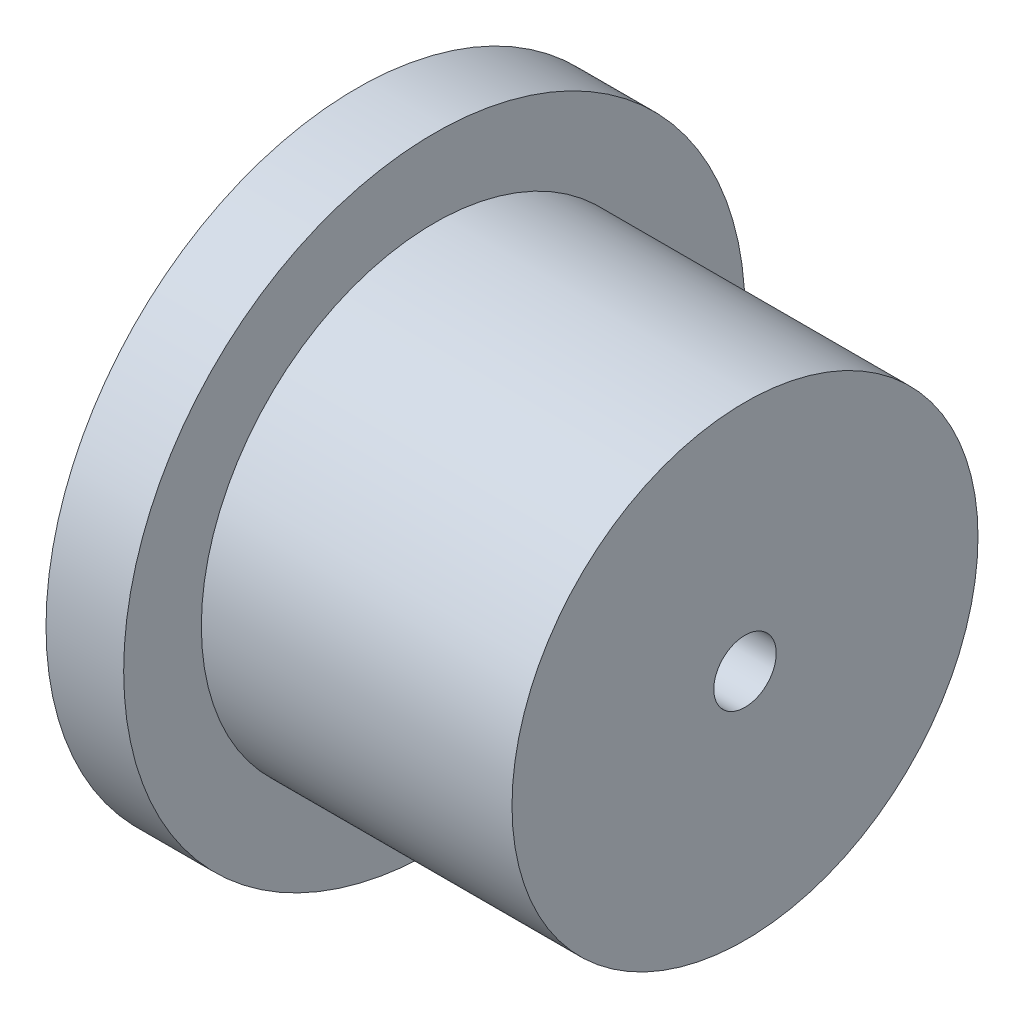
ISO-10303-21;
HEADER;
FILE_DESCRIPTION(('STEP AP214'),'2;1');
FILE_NAME('part.step','',(''),(''),'','','');
FILE_SCHEMA(('AUTOMOTIVE_DESIGN { 1 0 10303 214 1 1 1 1 }'));
ENDSEC;
DATA;
#1=APPLICATION_CONTEXT('core data for automotive mechanical design processes');
#2=APPLICATION_PROTOCOL_DEFINITION('international standard','automotive_design',2000,#1);
#3=PRODUCT_CONTEXT('',#1,'mechanical');
#4=PRODUCT('Part','Part','',(#3));
#5=PRODUCT_RELATED_PRODUCT_CATEGORY('part','',(#4));
#6=PRODUCT_DEFINITION_FORMATION('','',#4);
#7=PRODUCT_DEFINITION_CONTEXT('part definition',#1,'design');
#8=PRODUCT_DEFINITION('design','',#6,#7);
#9=PRODUCT_DEFINITION_SHAPE('','',#8);
#10=(LENGTH_UNIT() NAMED_UNIT(*) SI_UNIT(.MILLI.,.METRE.));
#11=(NAMED_UNIT(*) PLANE_ANGLE_UNIT() SI_UNIT($,.RADIAN.));
#12=(NAMED_UNIT(*) SI_UNIT($,.STERADIAN.) SOLID_ANGLE_UNIT());
#13=UNCERTAINTY_MEASURE_WITH_UNIT(LENGTH_MEASURE(1.E-05),#10,'distance_accuracy_value','');
#14=(GEOMETRIC_REPRESENTATION_CONTEXT(3) GLOBAL_UNCERTAINTY_ASSIGNED_CONTEXT((#13)) GLOBAL_UNIT_ASSIGNED_CONTEXT((#10,
#11,#12)) REPRESENTATION_CONTEXT('',''));
#15=CARTESIAN_POINT('',(0.,0.,0.));
#16=DIRECTION('',(0.,0.,1.));
#17=DIRECTION('',(1.,0.,0.));
#18=AXIS2_PLACEMENT_3D('',#15,#16,#17);
#19=CARTESIAN_POINT('',(0.,0.,0.));
#20=DIRECTION('',(1.,0.,0.));
#21=DIRECTION('',(0.,0.,-1.));
#22=AXIS2_PLACEMENT_3D('',#19,#20,#21);
#23=PLANE('',#22);
#24=CARTESIAN_POINT('',(0.,0.,0.));
#25=DIRECTION('',(-1.,0.,0.));
#26=DIRECTION('',(0.,0.,1.));
#27=AXIS2_PLACEMENT_3D('',#24,#25,#26);
#28=CIRCLE('',#27,2.5527);
#29=CARTESIAN_POINT('',(0.,0.,2.5527));
#30=VERTEX_POINT('',#29);
#31=EDGE_CURVE('E58',#30,#30,#28,.T.);
#32=ORIENTED_EDGE('',*,*,#31,.T.);
#33=EDGE_LOOP('',(#32));
#34=FACE_BOUND('',#33,.T.);
#35=CARTESIAN_POINT('',(0.,0.,0.));
#36=DIRECTION('',(-1.,0.,0.));
#37=DIRECTION('',(0.,0.,1.));
#38=AXIS2_PLACEMENT_3D('',#35,#36,#37);
#39=CIRCLE('',#38,19.05);
#40=CARTESIAN_POINT('',(0.,0.,19.05));
#41=VERTEX_POINT('',#40);
#42=EDGE_CURVE('E10',#41,#41,#39,.T.);
#43=ORIENTED_EDGE('',*,*,#42,.F.);
#44=EDGE_LOOP('',(#43));
#45=FACE_BOUND('',#44,.T.);
#46=ADVANCED_FACE('F39',(#34,#45),#23,.T.);
#47=CARTESIAN_POINT('',(-45.9651522554223,0.,0.));
#48=DIRECTION('',(-1.,0.,0.));
#49=DIRECTION('',(0.,0.,1.));
#50=AXIS2_PLACEMENT_3D('',#47,#48,#49);
#51=CYLINDRICAL_SURFACE('',#50,19.05);
#52=ORIENTED_EDGE('',*,*,#42,.T.);
#53=EDGE_LOOP('',(#52));
#54=FACE_BOUND('',#53,.T.);
#55=CARTESIAN_POINT('',(-25.4,0.,0.));
#56=DIRECTION('',(-1.,0.,0.));
#57=DIRECTION('',(0.,0.,1.));
#58=AXIS2_PLACEMENT_3D('',#55,#56,#57);
#59=CIRCLE('',#58,19.05);
#60=CARTESIAN_POINT('',(-25.4,0.,19.05));
#61=VERTEX_POINT('',#60);
#62=EDGE_CURVE('E45',#61,#61,#59,.T.);
#63=ORIENTED_EDGE('',*,*,#62,.F.);
#64=EDGE_LOOP('',(#63));
#65=FACE_BOUND('',#64,.T.);
#66=ADVANCED_FACE('F86',(#54,#65),#51,.T.);
#67=CARTESIAN_POINT('',(-25.4,-19.05,0.));
#68=DIRECTION('',(1.,0.,0.));
#69=DIRECTION('',(0.,0.,-1.));
#70=AXIS2_PLACEMENT_3D('',#67,#68,#69);
#71=PLANE('',#70);
#72=ORIENTED_EDGE('',*,*,#62,.T.);
#73=EDGE_LOOP('',(#72));
#74=FACE_BOUND('',#73,.T.);
#75=CARTESIAN_POINT('',(-25.4,0.,0.));
#76=DIRECTION('',(-1.,0.,0.));
#77=DIRECTION('',(0.,0.,1.));
#78=AXIS2_PLACEMENT_3D('',#75,#76,#77);
#79=CIRCLE('',#78,25.4);
#80=CARTESIAN_POINT('',(-25.4,0.,25.4));
#81=VERTEX_POINT('',#80);
#82=EDGE_CURVE('E49',#81,#81,#79,.T.);
#83=ORIENTED_EDGE('',*,*,#82,.F.);
#84=EDGE_LOOP('',(#83));
#85=FACE_BOUND('',#84,.T.);
#86=ADVANCED_FACE('F79',(#74,#85),#71,.T.);
#87=CARTESIAN_POINT('',(-45.9651522554223,0.,0.));
#88=DIRECTION('',(-1.,0.,0.));
#89=DIRECTION('',(0.,0.,1.));
#90=AXIS2_PLACEMENT_3D('',#87,#88,#89);
#91=CYLINDRICAL_SURFACE('',#90,25.4);
#92=ORIENTED_EDGE('',*,*,#82,.T.);
#93=EDGE_LOOP('',(#92));
#94=FACE_BOUND('',#93,.T.);
#95=CARTESIAN_POINT('',(-31.75,0.,0.));
#96=DIRECTION('',(-1.,0.,0.));
#97=DIRECTION('',(0.,0.,1.));
#98=AXIS2_PLACEMENT_3D('',#95,#96,#97);
#99=CIRCLE('',#98,25.4);
#100=CARTESIAN_POINT('',(-31.75,0.,25.4));
#101=VERTEX_POINT('',#100);
#102=EDGE_CURVE('E53',#101,#101,#99,.T.);
#103=ORIENTED_EDGE('',*,*,#102,.F.);
#104=EDGE_LOOP('',(#103));
#105=FACE_BOUND('',#104,.T.);
#106=ADVANCED_FACE('F74',(#94,#105),#91,.T.);
#107=CARTESIAN_POINT('',(-31.75,-25.4,0.));
#108=DIRECTION('',(-1.,0.,0.));
#109=DIRECTION('',(0.,0.,1.));
#110=AXIS2_PLACEMENT_3D('',#107,#108,#109);
#111=PLANE('',#110);
#112=CARTESIAN_POINT('',(-31.75,0.,0.));
#113=DIRECTION('',(-1.,0.,0.));
#114=DIRECTION('',(0.,0.,1.));
#115=AXIS2_PLACEMENT_3D('',#112,#113,#114);
#116=CIRCLE('',#115,3.81);
#117=CARTESIAN_POINT('',(-31.75,0.,3.81));
#118=VERTEX_POINT('',#117);
#119=EDGE_CURVE('E64',#118,#118,#116,.T.);
#120=ORIENTED_EDGE('',*,*,#119,.F.);
#121=EDGE_LOOP('',(#120));
#122=FACE_BOUND('',#121,.T.);
#123=ORIENTED_EDGE('',*,*,#102,.T.);
#124=EDGE_LOOP('',(#123));
#125=FACE_BOUND('',#124,.T.);
#126=ADVANCED_FACE('F70',(#122,#125),#111,.T.);
#127=CARTESIAN_POINT('',(-31.75,0.,0.));
#128=DIRECTION('',(-1.,0.,0.));
#129=DIRECTION('',(0.,0.,1.));
#130=AXIS2_PLACEMENT_3D('',#127,#128,#129);
#131=CYLINDRICAL_SURFACE('',#130,2.5527);
#132=ORIENTED_EDGE('',*,*,#31,.F.);
#133=EDGE_LOOP('',(#132));
#134=FACE_BOUND('',#133,.T.);
#135=CARTESIAN_POINT('',(-30.6950000337208,0.,0.));
#136=DIRECTION('',(-1.,0.,0.));
#137=DIRECTION('',(0.,0.,1.));
#138=AXIS2_PLACEMENT_3D('',#135,#136,#137);
#139=CIRCLE('',#138,2.5527);
#140=CARTESIAN_POINT('',(-30.6950000337208,0.,2.5527));
#141=VERTEX_POINT('',#140);
#142=EDGE_CURVE('E61',#141,#141,#139,.T.);
#143=ORIENTED_EDGE('',*,*,#142,.T.);
#144=EDGE_LOOP('',(#143));
#145=FACE_BOUND('',#144,.T.);
#146=ADVANCED_FACE('F73',(#134,#145),#131,.F.);
#147=CARTESIAN_POINT('',(-31.75,0.,0.));
#148=DIRECTION('',(-1.,0.,0.));
#149=DIRECTION('',(0.,0.,1.));
#150=AXIS2_PLACEMENT_3D('',#147,#148,#149);
#151=CONICAL_SURFACE('',#150,3.81,0.872664625997165);
#152=ORIENTED_EDGE('',*,*,#142,.F.);
#153=EDGE_LOOP('',(#152));
#154=FACE_BOUND('',#153,.T.);
#155=ORIENTED_EDGE('',*,*,#119,.T.);
#156=EDGE_LOOP('',(#155));
#157=FACE_BOUND('',#156,.T.);
#158=ADVANCED_FACE('F68',(#154,#157),#151,.F.);
#159=CLOSED_SHELL('',(#46,#66,#86,#106,#126,#146,#158));
#160=MANIFOLD_SOLID_BREP('B2',#159);
#161=ADVANCED_BREP_SHAPE_REPRESENTATION('',(#18,#160),#14);
#162=SHAPE_DEFINITION_REPRESENTATION(#9,#161);
ENDSEC;
END-ISO-10303-21;
